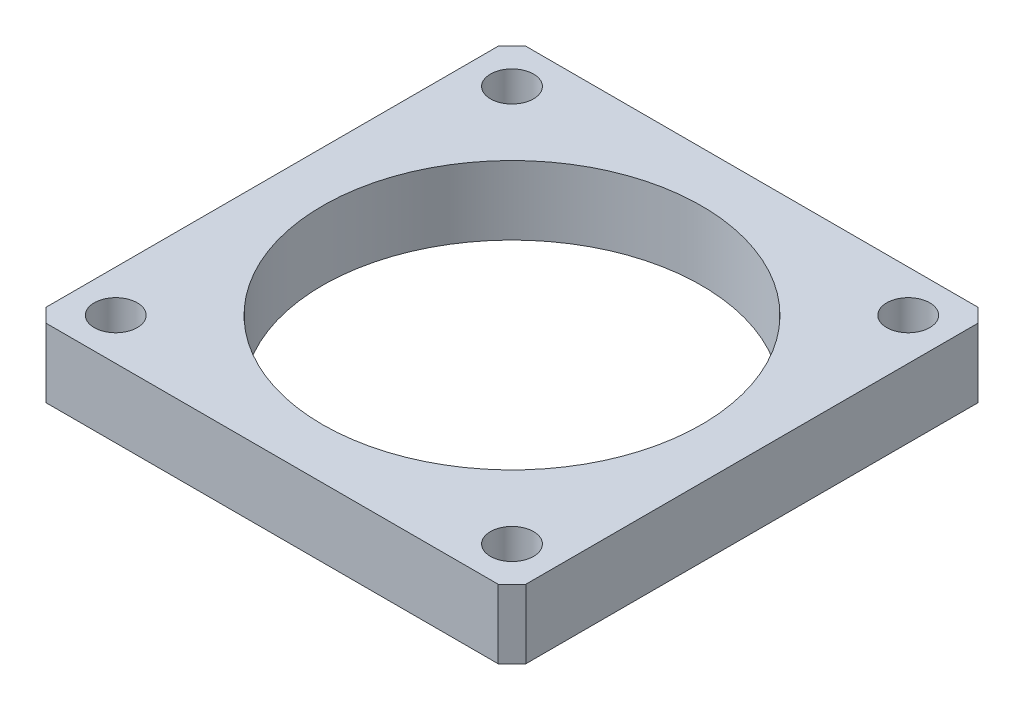
ISO-10303-21;
HEADER;
FILE_DESCRIPTION(('STEP AP214'),'2;1');
FILE_NAME('part.step','',(''),(''),'','','');
FILE_SCHEMA(('AUTOMOTIVE_DESIGN { 1 0 10303 214 1 1 1 1 }'));
ENDSEC;
DATA;
#1=APPLICATION_CONTEXT('core data for automotive mechanical design processes');
#2=APPLICATION_PROTOCOL_DEFINITION('international standard','automotive_design',2000,#1);
#3=PRODUCT_CONTEXT('',#1,'mechanical');
#4=PRODUCT('Part','Part','',(#3));
#5=PRODUCT_RELATED_PRODUCT_CATEGORY('part','',(#4));
#6=PRODUCT_DEFINITION_FORMATION('','',#4);
#7=PRODUCT_DEFINITION_CONTEXT('part definition',#1,'design');
#8=PRODUCT_DEFINITION('design','',#6,#7);
#9=PRODUCT_DEFINITION_SHAPE('','',#8);
#10=(LENGTH_UNIT() NAMED_UNIT(*) SI_UNIT(.MILLI.,.METRE.));
#11=(NAMED_UNIT(*) PLANE_ANGLE_UNIT() SI_UNIT($,.RADIAN.));
#12=(NAMED_UNIT(*) SI_UNIT($,.STERADIAN.) SOLID_ANGLE_UNIT());
#13=UNCERTAINTY_MEASURE_WITH_UNIT(LENGTH_MEASURE(1.E-05),#10,'distance_accuracy_value','');
#14=(GEOMETRIC_REPRESENTATION_CONTEXT(3) GLOBAL_UNCERTAINTY_ASSIGNED_CONTEXT((#13)) GLOBAL_UNIT_ASSIGNED_CONTEXT((#10,
#11,#12)) REPRESENTATION_CONTEXT('',''));
#15=CARTESIAN_POINT('',(0.,0.,0.));
#16=DIRECTION('',(0.,0.,1.));
#17=DIRECTION('',(1.,0.,0.));
#18=AXIS2_PLACEMENT_3D('',#15,#16,#17);
#19=CARTESIAN_POINT('',(0.,4.,0.));
#20=DIRECTION('',(0.,1.,0.));
#21=DIRECTION('',(0.,0.,1.));
#22=AXIS2_PLACEMENT_3D('',#19,#20,#21);
#23=PLANE('',#22);
#24=CARTESIAN_POINT('',(11.5,4.,-11.5));
#25=DIRECTION('',(0.,1.,0.));
#26=DIRECTION('',(0.,0.,1.));
#27=AXIS2_PLACEMENT_3D('',#24,#25,#26);
#28=CIRCLE('',#27,1.25);
#29=CARTESIAN_POINT('',(11.5,4.,-10.25));
#30=VERTEX_POINT('',#29);
#31=EDGE_CURVE('E193',#30,#30,#28,.T.);
#32=ORIENTED_EDGE('',*,*,#31,.F.);
#33=EDGE_LOOP('',(#32));
#34=FACE_BOUND('',#33,.T.);
#35=CARTESIAN_POINT('',(-11.5,4.,11.5));
#36=DIRECTION('',(0.,1.,0.));
#37=DIRECTION('',(0.,0.,1.));
#38=AXIS2_PLACEMENT_3D('',#35,#36,#37);
#39=CIRCLE('',#38,1.25);
#40=CARTESIAN_POINT('',(-11.5,4.,12.75));
#41=VERTEX_POINT('',#40);
#42=EDGE_CURVE('E182',#41,#41,#39,.T.);
#43=ORIENTED_EDGE('',*,*,#42,.F.);
#44=EDGE_LOOP('',(#43));
#45=FACE_BOUND('',#44,.T.);
#46=DIRECTION('',(0.,0.,-1.));
#47=VECTOR('',#46,1.);
#48=CARTESIAN_POINT('',(13.925,4.,13.925));
#49=LINE('',#48,#47);
#50=CARTESIAN_POINT('',(13.925,4.,13.125));
#51=VERTEX_POINT('',#50);
#52=CARTESIAN_POINT('',(13.925,4.,-13.125));
#53=VERTEX_POINT('',#52);
#54=EDGE_CURVE('E137',#51,#53,#49,.T.);
#55=ORIENTED_EDGE('',*,*,#54,.T.);
#56=DIRECTION('',(0.707106781186544,0.,0.707106781186551));
#57=VECTOR('',#56,1.);
#58=CARTESIAN_POINT('',(13.5250000000001,4.,-13.5249999999999));
#59=LINE('',#58,#57);
#60=CARTESIAN_POINT('',(13.125,4.,-13.925));
#61=VERTEX_POINT('',#60);
#62=EDGE_CURVE('E156',#53,#61,#59,.F.);
#63=ORIENTED_EDGE('',*,*,#62,.T.);
#64=DIRECTION('',(-1.,0.,0.));
#65=VECTOR('',#64,1.);
#66=CARTESIAN_POINT('',(-13.925,4.,-13.925));
#67=LINE('',#66,#65);
#68=CARTESIAN_POINT('',(-13.125,4.,-13.925));
#69=VERTEX_POINT('',#68);
#70=EDGE_CURVE('E120',#61,#69,#67,.T.);
#71=ORIENTED_EDGE('',*,*,#70,.T.);
#72=DIRECTION('',(0.707106781186551,0.,-0.707106781186544));
#73=VECTOR('',#72,1.);
#74=CARTESIAN_POINT('',(-13.5249999999999,4.,-13.5250000000001));
#75=LINE('',#74,#73);
#76=CARTESIAN_POINT('',(-13.925,4.,-13.125));
#77=VERTEX_POINT('',#76);
#78=EDGE_CURVE('E151',#69,#77,#75,.F.);
#79=ORIENTED_EDGE('',*,*,#78,.T.);
#80=DIRECTION('',(0.,0.,1.));
#81=VECTOR('',#80,1.);
#82=CARTESIAN_POINT('',(-13.925,4.,13.925));
#83=LINE('',#82,#81);
#84=CARTESIAN_POINT('',(-13.925,4.,13.125));
#85=VERTEX_POINT('',#84);
#86=EDGE_CURVE('E167',#77,#85,#83,.T.);
#87=ORIENTED_EDGE('',*,*,#86,.T.);
#88=DIRECTION('',(-0.707106781186544,0.,-0.707106781186551));
#89=VECTOR('',#88,1.);
#90=CARTESIAN_POINT('',(-13.5250000000001,4.,13.5249999999999));
#91=LINE('',#90,#89);
#92=CARTESIAN_POINT('',(-13.125,4.,13.925));
#93=VERTEX_POINT('',#92);
#94=EDGE_CURVE('E56',#85,#93,#91,.F.);
#95=ORIENTED_EDGE('',*,*,#94,.T.);
#96=DIRECTION('',(1.,0.,0.));
#97=VECTOR('',#96,1.);
#98=CARTESIAN_POINT('',(-13.925,4.,13.925));
#99=LINE('',#98,#97);
#100=CARTESIAN_POINT('',(13.125,4.,13.925));
#101=VERTEX_POINT('',#100);
#102=EDGE_CURVE('E175',#93,#101,#99,.T.);
#103=ORIENTED_EDGE('',*,*,#102,.T.);
#104=DIRECTION('',(-0.707106781186551,0.,0.707106781186544));
#105=VECTOR('',#104,1.);
#106=CARTESIAN_POINT('',(13.5249999999999,4.,13.5250000000001));
#107=LINE('',#106,#105);
#108=EDGE_CURVE('E154',#101,#51,#107,.F.);
#109=ORIENTED_EDGE('',*,*,#108,.T.);
#110=EDGE_LOOP('',(#55,#63,#71,#79,#87,#95,#103,#109));
#111=FACE_BOUND('',#110,.T.);
#112=CARTESIAN_POINT('',(-11.5,4.,-11.5));
#113=DIRECTION('',(0.,1.,0.));
#114=DIRECTION('',(0.,0.,1.));
#115=AXIS2_PLACEMENT_3D('',#112,#113,#114);
#116=CIRCLE('',#115,1.25);
#117=CARTESIAN_POINT('',(-11.5,4.,-10.25));
#118=VERTEX_POINT('',#117);
#119=EDGE_CURVE('E128',#118,#118,#116,.T.);
#120=ORIENTED_EDGE('',*,*,#119,.F.);
#121=EDGE_LOOP('',(#120));
#122=FACE_BOUND('',#121,.T.);
#123=CARTESIAN_POINT('',(11.5,4.,11.5));
#124=DIRECTION('',(0.,1.,0.));
#125=DIRECTION('',(0.,0.,1.));
#126=AXIS2_PLACEMENT_3D('',#123,#124,#125);
#127=CIRCLE('',#126,1.25);
#128=CARTESIAN_POINT('',(11.5,4.,12.75));
#129=VERTEX_POINT('',#128);
#130=EDGE_CURVE('E187',#129,#129,#127,.T.);
#131=ORIENTED_EDGE('',*,*,#130,.F.);
#132=EDGE_LOOP('',(#131));
#133=FACE_BOUND('',#132,.T.);
#134=CARTESIAN_POINT('',(0.,4.,0.));
#135=DIRECTION('',(0.,1.,0.));
#136=DIRECTION('',(0.,0.,1.));
#137=AXIS2_PLACEMENT_3D('',#134,#135,#136);
#138=CIRCLE('',#137,11.);
#139=CARTESIAN_POINT('',(0.,4.,11.));
#140=VERTEX_POINT('',#139);
#141=EDGE_CURVE('E199',#140,#140,#138,.T.);
#142=ORIENTED_EDGE('',*,*,#141,.F.);
#143=EDGE_LOOP('',(#142));
#144=FACE_BOUND('',#143,.T.);
#145=ADVANCED_FACE('F34',(#34,#45,#111,#122,#133,#144),#23,.T.);
#146=CARTESIAN_POINT('',(0.,0.,0.));
#147=DIRECTION('',(0.,1.,0.));
#148=DIRECTION('',(0.,0.,1.));
#149=AXIS2_PLACEMENT_3D('',#146,#147,#148);
#150=PLANE('',#149);
#151=CARTESIAN_POINT('',(11.5,0.,-11.5));
#152=DIRECTION('',(0.,1.,0.));
#153=DIRECTION('',(0.,0.,1.));
#154=AXIS2_PLACEMENT_3D('',#151,#152,#153);
#155=CIRCLE('',#154,1.25);
#156=CARTESIAN_POINT('',(11.5,0.,-10.25));
#157=VERTEX_POINT('',#156);
#158=EDGE_CURVE('E196',#157,#157,#155,.T.);
#159=ORIENTED_EDGE('',*,*,#158,.T.);
#160=EDGE_LOOP('',(#159));
#161=FACE_BOUND('',#160,.T.);
#162=CARTESIAN_POINT('',(-11.5,0.,11.5));
#163=DIRECTION('',(0.,1.,0.));
#164=DIRECTION('',(0.,0.,1.));
#165=AXIS2_PLACEMENT_3D('',#162,#163,#164);
#166=CIRCLE('',#165,1.25);
#167=CARTESIAN_POINT('',(-11.5,0.,12.75));
#168=VERTEX_POINT('',#167);
#169=EDGE_CURVE('E184',#168,#168,#166,.T.);
#170=ORIENTED_EDGE('',*,*,#169,.T.);
#171=EDGE_LOOP('',(#170));
#172=FACE_BOUND('',#171,.T.);
#173=DIRECTION('',(-1.,0.,0.));
#174=VECTOR('',#173,1.);
#175=CARTESIAN_POINT('',(-13.925,0.,-13.925));
#176=LINE('',#175,#174);
#177=CARTESIAN_POINT('',(13.125,0.,-13.925));
#178=VERTEX_POINT('',#177);
#179=CARTESIAN_POINT('',(-13.125,0.,-13.925));
#180=VERTEX_POINT('',#179);
#181=EDGE_CURVE('E117',#178,#180,#176,.T.);
#182=ORIENTED_EDGE('',*,*,#181,.F.);
#183=DIRECTION('',(-0.707106781186544,0.,-0.707106781186551));
#184=VECTOR('',#183,1.);
#185=CARTESIAN_POINT('',(13.125,0.,-13.925));
#186=LINE('',#185,#184);
#187=CARTESIAN_POINT('',(13.925,0.,-13.125));
#188=VERTEX_POINT('',#187);
#189=EDGE_CURVE('E100',#178,#188,#186,.F.);
#190=ORIENTED_EDGE('',*,*,#189,.T.);
#191=DIRECTION('',(0.,0.,-1.));
#192=VECTOR('',#191,1.);
#193=CARTESIAN_POINT('',(13.925,0.,13.925));
#194=LINE('',#193,#192);
#195=CARTESIAN_POINT('',(13.925,0.,13.125));
#196=VERTEX_POINT('',#195);
#197=EDGE_CURVE('E141',#196,#188,#194,.T.);
#198=ORIENTED_EDGE('',*,*,#197,.F.);
#199=DIRECTION('',(0.707106781186551,0.,-0.707106781186544));
#200=VECTOR('',#199,1.);
#201=CARTESIAN_POINT('',(13.925,0.,13.125));
#202=LINE('',#201,#200);
#203=CARTESIAN_POINT('',(13.125,0.,13.925));
#204=VERTEX_POINT('',#203);
#205=EDGE_CURVE('E111',#196,#204,#202,.F.);
#206=ORIENTED_EDGE('',*,*,#205,.T.);
#207=DIRECTION('',(1.,0.,0.));
#208=VECTOR('',#207,1.);
#209=CARTESIAN_POINT('',(-13.925,0.,13.925));
#210=LINE('',#209,#208);
#211=CARTESIAN_POINT('',(-13.125,0.,13.925));
#212=VERTEX_POINT('',#211);
#213=EDGE_CURVE('E131',#212,#204,#210,.T.);
#214=ORIENTED_EDGE('',*,*,#213,.F.);
#215=DIRECTION('',(0.707106781186544,0.,0.707106781186551));
#216=VECTOR('',#215,1.);
#217=CARTESIAN_POINT('',(-13.125,0.,13.925));
#218=LINE('',#217,#216);
#219=CARTESIAN_POINT('',(-13.925,0.,13.125));
#220=VERTEX_POINT('',#219);
#221=EDGE_CURVE('E145',#212,#220,#218,.F.);
#222=ORIENTED_EDGE('',*,*,#221,.T.);
#223=DIRECTION('',(0.,0.,1.));
#224=VECTOR('',#223,1.);
#225=CARTESIAN_POINT('',(-13.925,0.,13.925));
#226=LINE('',#225,#224);
#227=CARTESIAN_POINT('',(-13.925,0.,-13.125));
#228=VERTEX_POINT('',#227);
#229=EDGE_CURVE('E127',#228,#220,#226,.T.);
#230=ORIENTED_EDGE('',*,*,#229,.F.);
#231=DIRECTION('',(-0.707106781186551,0.,0.707106781186544));
#232=VECTOR('',#231,1.);
#233=CARTESIAN_POINT('',(-13.925,0.,-13.125));
#234=LINE('',#233,#232);
#235=EDGE_CURVE('E121',#228,#180,#234,.F.);
#236=ORIENTED_EDGE('',*,*,#235,.T.);
#237=EDGE_LOOP('',(#182,#190,#198,#206,#214,#222,#230,#236));
#238=FACE_BOUND('',#237,.T.);
#239=CARTESIAN_POINT('',(-11.5,0.,-11.5));
#240=DIRECTION('',(0.,1.,0.));
#241=DIRECTION('',(0.,0.,1.));
#242=AXIS2_PLACEMENT_3D('',#239,#240,#241);
#243=CIRCLE('',#242,1.25);
#244=CARTESIAN_POINT('',(-11.5,0.,-10.25));
#245=VERTEX_POINT('',#244);
#246=EDGE_CURVE('E134',#245,#245,#243,.T.);
#247=ORIENTED_EDGE('',*,*,#246,.T.);
#248=EDGE_LOOP('',(#247));
#249=FACE_BOUND('',#248,.T.);
#250=CARTESIAN_POINT('',(11.5,0.,11.5));
#251=DIRECTION('',(0.,1.,0.));
#252=DIRECTION('',(0.,0.,1.));
#253=AXIS2_PLACEMENT_3D('',#250,#251,#252);
#254=CIRCLE('',#253,1.25);
#255=CARTESIAN_POINT('',(11.5,0.,12.75));
#256=VERTEX_POINT('',#255);
#257=EDGE_CURVE('E190',#256,#256,#254,.T.);
#258=ORIENTED_EDGE('',*,*,#257,.T.);
#259=EDGE_LOOP('',(#258));
#260=FACE_BOUND('',#259,.T.);
#261=CARTESIAN_POINT('',(0.,0.,0.));
#262=DIRECTION('',(0.,1.,0.));
#263=DIRECTION('',(0.,0.,1.));
#264=AXIS2_PLACEMENT_3D('',#261,#262,#263);
#265=CIRCLE('',#264,11.);
#266=CARTESIAN_POINT('',(0.,0.,11.));
#267=VERTEX_POINT('',#266);
#268=EDGE_CURVE('E202',#267,#267,#265,.T.);
#269=ORIENTED_EDGE('',*,*,#268,.T.);
#270=EDGE_LOOP('',(#269));
#271=FACE_BOUND('',#270,.T.);
#272=ADVANCED_FACE('F124',(#161,#172,#238,#249,#260,#271),#150,.F.);
#273=CARTESIAN_POINT('',(-13.925,4.,-13.925));
#274=DIRECTION('',(0.,0.,1.));
#275=DIRECTION('',(1.,0.,0.));
#276=AXIS2_PLACEMENT_3D('',#273,#274,#275);
#277=PLANE('',#276);
#278=ORIENTED_EDGE('',*,*,#70,.F.);
#279=DIRECTION('',(0.,-1.,0.));
#280=VECTOR('',#279,1.);
#281=CARTESIAN_POINT('',(13.125,4.,-13.925));
#282=LINE('',#281,#280);
#283=EDGE_CURVE('E104',#61,#178,#282,.T.);
#284=ORIENTED_EDGE('',*,*,#283,.T.);
#285=ORIENTED_EDGE('',*,*,#181,.T.);
#286=DIRECTION('',(0.,1.,0.));
#287=VECTOR('',#286,1.);
#288=CARTESIAN_POINT('',(-13.125,4.,-13.925));
#289=LINE('',#288,#287);
#290=EDGE_CURVE('E122',#180,#69,#289,.T.);
#291=ORIENTED_EDGE('',*,*,#290,.T.);
#292=EDGE_LOOP('',(#278,#284,#285,#291));
#293=FACE_BOUND('',#292,.T.);
#294=ADVANCED_FACE('F116',(#293),#277,.F.);
#295=CARTESIAN_POINT('',(-13.925,4.,13.925));
#296=DIRECTION('',(1.,0.,0.));
#297=DIRECTION('',(0.,0.,-1.));
#298=AXIS2_PLACEMENT_3D('',#295,#296,#297);
#299=PLANE('',#298);
#300=ORIENTED_EDGE('',*,*,#229,.T.);
#301=DIRECTION('',(0.,1.,0.));
#302=VECTOR('',#301,1.);
#303=CARTESIAN_POINT('',(-13.925,4.,13.125));
#304=LINE('',#303,#302);
#305=EDGE_CURVE('E11',#220,#85,#304,.T.);
#306=ORIENTED_EDGE('',*,*,#305,.T.);
#307=ORIENTED_EDGE('',*,*,#86,.F.);
#308=DIRECTION('',(0.,-1.,0.));
#309=VECTOR('',#308,1.);
#310=CARTESIAN_POINT('',(-13.925,4.,-13.125));
#311=LINE('',#310,#309);
#312=EDGE_CURVE('E42',#77,#228,#311,.T.);
#313=ORIENTED_EDGE('',*,*,#312,.T.);
#314=EDGE_LOOP('',(#300,#306,#307,#313));
#315=FACE_BOUND('',#314,.T.);
#316=ADVANCED_FACE('F165',(#315),#299,.F.);
#317=CARTESIAN_POINT('',(-13.925,4.,13.925));
#318=DIRECTION('',(0.,0.,-1.));
#319=DIRECTION('',(-1.,0.,0.));
#320=AXIS2_PLACEMENT_3D('',#317,#318,#319);
#321=PLANE('',#320);
#322=ORIENTED_EDGE('',*,*,#213,.T.);
#323=DIRECTION('',(0.,1.,0.));
#324=VECTOR('',#323,1.);
#325=CARTESIAN_POINT('',(13.125,4.,13.925));
#326=LINE('',#325,#324);
#327=EDGE_CURVE('E49',#204,#101,#326,.T.);
#328=ORIENTED_EDGE('',*,*,#327,.T.);
#329=ORIENTED_EDGE('',*,*,#102,.F.);
#330=DIRECTION('',(0.,-1.,0.));
#331=VECTOR('',#330,1.);
#332=CARTESIAN_POINT('',(-13.125,4.,13.925));
#333=LINE('',#332,#331);
#334=EDGE_CURVE('E158',#93,#212,#333,.T.);
#335=ORIENTED_EDGE('',*,*,#334,.T.);
#336=EDGE_LOOP('',(#322,#328,#329,#335));
#337=FACE_BOUND('',#336,.T.);
#338=ADVANCED_FACE('F174',(#337),#321,.F.);
#339=CARTESIAN_POINT('',(13.925,4.,13.925));
#340=DIRECTION('',(-1.,0.,0.));
#341=DIRECTION('',(0.,0.,1.));
#342=AXIS2_PLACEMENT_3D('',#339,#340,#341);
#343=PLANE('',#342);
#344=ORIENTED_EDGE('',*,*,#197,.T.);
#345=DIRECTION('',(0.,1.,0.));
#346=VECTOR('',#345,1.);
#347=CARTESIAN_POINT('',(13.925,4.,-13.125));
#348=LINE('',#347,#346);
#349=EDGE_CURVE('E105',#188,#53,#348,.T.);
#350=ORIENTED_EDGE('',*,*,#349,.T.);
#351=ORIENTED_EDGE('',*,*,#54,.F.);
#352=DIRECTION('',(0.,-1.,0.));
#353=VECTOR('',#352,1.);
#354=CARTESIAN_POINT('',(13.925,4.,13.125));
#355=LINE('',#354,#353);
#356=EDGE_CURVE('E110',#51,#196,#355,.T.);
#357=ORIENTED_EDGE('',*,*,#356,.T.);
#358=EDGE_LOOP('',(#344,#350,#351,#357));
#359=FACE_BOUND('',#358,.T.);
#360=ADVANCED_FACE('F225',(#359),#343,.F.);
#361=CARTESIAN_POINT('',(-11.5,4.,-11.5));
#362=DIRECTION('',(0.,-1.,0.));
#363=DIRECTION('',(0.,0.,-1.));
#364=AXIS2_PLACEMENT_3D('',#361,#362,#363);
#365=CYLINDRICAL_SURFACE('',#364,1.25);
#366=ORIENTED_EDGE('',*,*,#119,.T.);
#367=EDGE_LOOP('',(#366));
#368=FACE_BOUND('',#367,.T.);
#369=ORIENTED_EDGE('',*,*,#246,.F.);
#370=EDGE_LOOP('',(#369));
#371=FACE_BOUND('',#370,.T.);
#372=ADVANCED_FACE('F222',(#368,#371),#365,.F.);
#373=CARTESIAN_POINT('',(-11.5,4.,11.5));
#374=DIRECTION('',(0.,-1.,0.));
#375=DIRECTION('',(0.,0.,-1.));
#376=AXIS2_PLACEMENT_3D('',#373,#374,#375);
#377=CYLINDRICAL_SURFACE('',#376,1.25);
#378=ORIENTED_EDGE('',*,*,#42,.T.);
#379=EDGE_LOOP('',(#378));
#380=FACE_BOUND('',#379,.T.);
#381=ORIENTED_EDGE('',*,*,#169,.F.);
#382=EDGE_LOOP('',(#381));
#383=FACE_BOUND('',#382,.T.);
#384=ADVANCED_FACE('F257',(#380,#383),#377,.F.);
#385=CARTESIAN_POINT('',(11.5,4.,11.5));
#386=DIRECTION('',(0.,-1.,0.));
#387=DIRECTION('',(0.,0.,-1.));
#388=AXIS2_PLACEMENT_3D('',#385,#386,#387);
#389=CYLINDRICAL_SURFACE('',#388,1.25);
#390=ORIENTED_EDGE('',*,*,#130,.T.);
#391=EDGE_LOOP('',(#390));
#392=FACE_BOUND('',#391,.T.);
#393=ORIENTED_EDGE('',*,*,#257,.F.);
#394=EDGE_LOOP('',(#393));
#395=FACE_BOUND('',#394,.T.);
#396=ADVANCED_FACE('F253',(#392,#395),#389,.F.);
#397=CARTESIAN_POINT('',(11.5,4.,-11.5));
#398=DIRECTION('',(0.,-1.,0.));
#399=DIRECTION('',(0.,0.,-1.));
#400=AXIS2_PLACEMENT_3D('',#397,#398,#399);
#401=CYLINDRICAL_SURFACE('',#400,1.25);
#402=ORIENTED_EDGE('',*,*,#31,.T.);
#403=EDGE_LOOP('',(#402));
#404=FACE_BOUND('',#403,.T.);
#405=ORIENTED_EDGE('',*,*,#158,.F.);
#406=EDGE_LOOP('',(#405));
#407=FACE_BOUND('',#406,.T.);
#408=ADVANCED_FACE('F256',(#404,#407),#401,.F.);
#409=CARTESIAN_POINT('',(0.,4.,0.));
#410=DIRECTION('',(0.,-1.,0.));
#411=DIRECTION('',(0.,0.,-1.));
#412=AXIS2_PLACEMENT_3D('',#409,#410,#411);
#413=CYLINDRICAL_SURFACE('',#412,11.);
#414=ORIENTED_EDGE('',*,*,#141,.T.);
#415=EDGE_LOOP('',(#414));
#416=FACE_BOUND('',#415,.T.);
#417=ORIENTED_EDGE('',*,*,#268,.F.);
#418=EDGE_LOOP('',(#417));
#419=FACE_BOUND('',#418,.T.);
#420=ADVANCED_FACE('F208',(#416,#419),#413,.F.);
#421=CARTESIAN_POINT('',(13.125,4.,-13.925));
#422=DIRECTION('',(-0.707106781186551,0.,0.707106781186544));
#423=DIRECTION('',(0.,-1.,0.));
#424=AXIS2_PLACEMENT_3D('',#421,#422,#423);
#425=PLANE('',#424);
#426=ORIENTED_EDGE('',*,*,#62,.F.);
#427=ORIENTED_EDGE('',*,*,#349,.F.);
#428=ORIENTED_EDGE('',*,*,#189,.F.);
#429=ORIENTED_EDGE('',*,*,#283,.F.);
#430=EDGE_LOOP('',(#426,#427,#428,#429));
#431=FACE_BOUND('',#430,.T.);
#432=ADVANCED_FACE('F103',(#431),#425,.F.);
#433=CARTESIAN_POINT('',(13.925,4.,13.125));
#434=DIRECTION('',(-0.707106781186544,0.,-0.707106781186551));
#435=DIRECTION('',(0.,-1.,0.));
#436=AXIS2_PLACEMENT_3D('',#433,#434,#435);
#437=PLANE('',#436);
#438=ORIENTED_EDGE('',*,*,#108,.F.);
#439=ORIENTED_EDGE('',*,*,#327,.F.);
#440=ORIENTED_EDGE('',*,*,#205,.F.);
#441=ORIENTED_EDGE('',*,*,#356,.F.);
#442=EDGE_LOOP('',(#438,#439,#440,#441));
#443=FACE_BOUND('',#442,.T.);
#444=ADVANCED_FACE('F237',(#443),#437,.F.);
#445=CARTESIAN_POINT('',(-13.125,4.,13.925));
#446=DIRECTION('',(0.707106781186551,0.,-0.707106781186544));
#447=DIRECTION('',(0.,-1.,0.));
#448=AXIS2_PLACEMENT_3D('',#445,#446,#447);
#449=PLANE('',#448);
#450=ORIENTED_EDGE('',*,*,#94,.F.);
#451=ORIENTED_EDGE('',*,*,#305,.F.);
#452=ORIENTED_EDGE('',*,*,#221,.F.);
#453=ORIENTED_EDGE('',*,*,#334,.F.);
#454=EDGE_LOOP('',(#450,#451,#452,#453));
#455=FACE_BOUND('',#454,.T.);
#456=ADVANCED_FACE('F173',(#455),#449,.F.);
#457=CARTESIAN_POINT('',(-13.925,4.,-13.125));
#458=DIRECTION('',(0.707106781186544,0.,0.707106781186551));
#459=DIRECTION('',(0.,-1.,0.));
#460=AXIS2_PLACEMENT_3D('',#457,#458,#459);
#461=PLANE('',#460);
#462=ORIENTED_EDGE('',*,*,#78,.F.);
#463=ORIENTED_EDGE('',*,*,#290,.F.);
#464=ORIENTED_EDGE('',*,*,#235,.F.);
#465=ORIENTED_EDGE('',*,*,#312,.F.);
#466=EDGE_LOOP('',(#462,#463,#464,#465));
#467=FACE_BOUND('',#466,.T.);
#468=ADVANCED_FACE('F36',(#467),#461,.F.);
#469=CLOSED_SHELL('',(#145,#272,#294,#316,#338,#360,#372,#384,#396,#408,#420,#432,#444,#456,#468));
#470=MANIFOLD_SOLID_BREP('B2',#469);
#471=ADVANCED_BREP_SHAPE_REPRESENTATION('',(#18,#470),#14);
#472=SHAPE_DEFINITION_REPRESENTATION(#9,#471);
ENDSEC;
END-ISO-10303-21;
